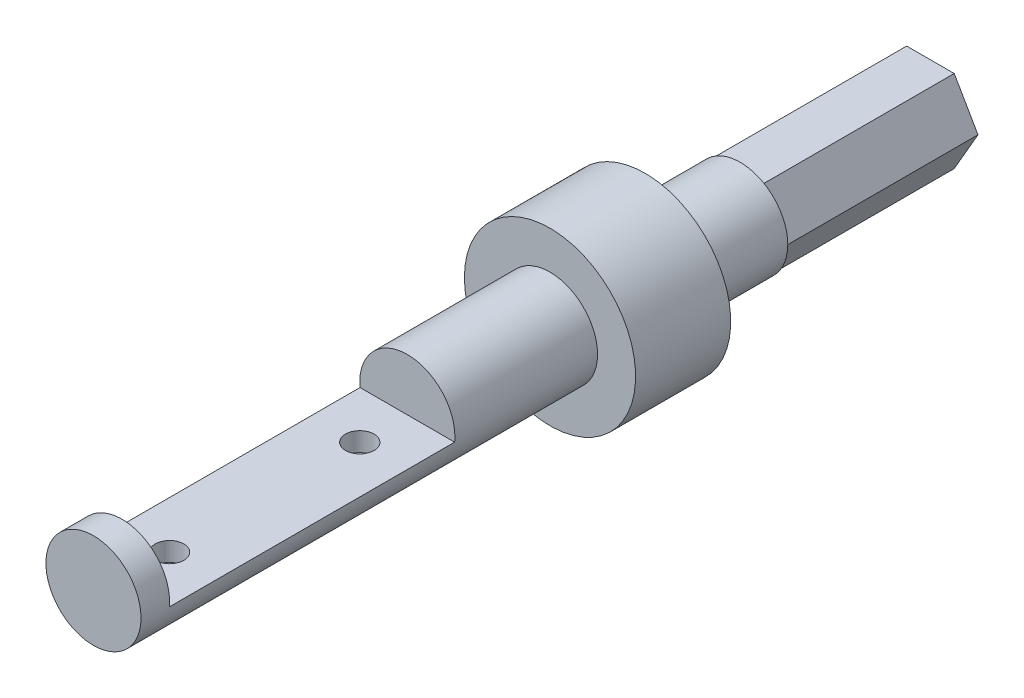
ISO-10303-21;
HEADER;
FILE_DESCRIPTION(('STEP AP214'),'2;1');
FILE_NAME('part.step','',(''),(''),'','','');
FILE_SCHEMA(('AUTOMOTIVE_DESIGN { 1 0 10303 214 1 1 1 1 }'));
ENDSEC;
DATA;
#1=APPLICATION_CONTEXT('core data for automotive mechanical design processes');
#2=APPLICATION_PROTOCOL_DEFINITION('international standard','automotive_design',2000,#1);
#3=PRODUCT_CONTEXT('',#1,'mechanical');
#4=PRODUCT('Part','Part','',(#3));
#5=PRODUCT_RELATED_PRODUCT_CATEGORY('part','',(#4));
#6=PRODUCT_DEFINITION_FORMATION('','',#4);
#7=PRODUCT_DEFINITION_CONTEXT('part definition',#1,'design');
#8=PRODUCT_DEFINITION('design','',#6,#7);
#9=PRODUCT_DEFINITION_SHAPE('','',#8);
#10=(LENGTH_UNIT() NAMED_UNIT(*) SI_UNIT(.MILLI.,.METRE.));
#11=(NAMED_UNIT(*) PLANE_ANGLE_UNIT() SI_UNIT($,.RADIAN.));
#12=(NAMED_UNIT(*) SI_UNIT($,.STERADIAN.) SOLID_ANGLE_UNIT());
#13=UNCERTAINTY_MEASURE_WITH_UNIT(LENGTH_MEASURE(1.E-05),#10,'distance_accuracy_value','');
#14=(GEOMETRIC_REPRESENTATION_CONTEXT(3) GLOBAL_UNCERTAINTY_ASSIGNED_CONTEXT((#13)) GLOBAL_UNIT_ASSIGNED_CONTEXT((#10,
#11,#12)) REPRESENTATION_CONTEXT('',''));
#15=CARTESIAN_POINT('',(0.,0.,0.));
#16=DIRECTION('',(0.,0.,1.));
#17=DIRECTION('',(1.,0.,0.));
#18=AXIS2_PLACEMENT_3D('',#15,#16,#17);
#19=CARTESIAN_POINT('',(0.,0.,-20.));
#20=DIRECTION('',(0.,0.,-1.));
#21=DIRECTION('',(-1.,0.,0.));
#22=AXIS2_PLACEMENT_3D('',#19,#20,#21);
#23=PLANE('',#22);
#24=DIRECTION('',(0.499999999999995,-0.866025403784442,0.));
#25=VECTOR('',#24,1.);
#26=CARTESIAN_POINT('',(2.50000000000005,4.33012701892217,-20.));
#27=LINE('',#26,#25);
#28=CARTESIAN_POINT('',(2.50000000000005,4.33012701892216,-20.));
#29=VERTEX_POINT('',#28);
#30=CARTESIAN_POINT('',(4.99999999999999,0.,-20.));
#31=VERTEX_POINT('',#30);
#32=EDGE_CURVE('E182',#29,#31,#27,.T.);
#33=ORIENTED_EDGE('',*,*,#32,.F.);
#34=CARTESIAN_POINT('',(0.,0.,-20.));
#35=DIRECTION('',(0.,0.,-1.));
#36=DIRECTION('',(-1.,0.,0.));
#37=AXIS2_PLACEMENT_3D('',#34,#35,#36);
#38=CIRCLE('',#37,5.);
#39=EDGE_CURVE('E291',#29,#31,#38,.T.);
#40=ORIENTED_EDGE('',*,*,#39,.T.);
#41=EDGE_LOOP('',(#33,#40));
#42=FACE_BOUND('',#41,.T.);
#43=ADVANCED_FACE('F50',(#42),#23,.T.);
#44=DIRECTION('',(1.,0.,0.));
#45=VECTOR('',#44,1.);
#46=CARTESIAN_POINT('',(-2.49999999999997,4.33012701892221,-20.));
#47=LINE('',#46,#45);
#48=CARTESIAN_POINT('',(-2.49999999999997,4.33012701892221,-20.));
#49=VERTEX_POINT('',#48);
#50=EDGE_CURVE('E168',#49,#29,#47,.T.);
#51=ORIENTED_EDGE('',*,*,#50,.F.);
#52=EDGE_CURVE('E147',#49,#29,#38,.T.);
#53=ORIENTED_EDGE('',*,*,#52,.T.);
#54=EDGE_LOOP('',(#51,#53));
#55=FACE_BOUND('',#54,.T.);
#56=ADVANCED_FACE('F238',(#55),#23,.T.);
#57=DIRECTION('',(0.500000000000007,0.866025403784435,0.));
#58=VECTOR('',#57,1.);
#59=CARTESIAN_POINT('',(-5.,0.,-20.));
#60=LINE('',#59,#58);
#61=CARTESIAN_POINT('',(-5.,0.,-20.));
#62=VERTEX_POINT('',#61);
#63=EDGE_CURVE('E172',#62,#49,#60,.T.);
#64=ORIENTED_EDGE('',*,*,#63,.F.);
#65=EDGE_CURVE('E140',#62,#49,#38,.T.);
#66=ORIENTED_EDGE('',*,*,#65,.T.);
#67=EDGE_LOOP('',(#64,#66));
#68=FACE_BOUND('',#67,.T.);
#69=ADVANCED_FACE('F245',(#68),#23,.T.);
#70=DIRECTION('',(-0.499999999999995,0.866025403784442,0.));
#71=VECTOR('',#70,1.);
#72=CARTESIAN_POINT('',(-2.50000000000002,-4.33012701892219,-20.));
#73=LINE('',#72,#71);
#74=CARTESIAN_POINT('',(-2.50000000000002,-4.33012701892219,-20.));
#75=VERTEX_POINT('',#74);
#76=EDGE_CURVE('E72',#75,#62,#73,.T.);
#77=ORIENTED_EDGE('',*,*,#76,.F.);
#78=EDGE_CURVE('E148',#75,#62,#38,.T.);
#79=ORIENTED_EDGE('',*,*,#78,.T.);
#80=EDGE_LOOP('',(#77,#79));
#81=FACE_BOUND('',#80,.T.);
#82=ADVANCED_FACE('F263',(#81),#23,.T.);
#83=DIRECTION('',(-1.,0.,0.));
#84=VECTOR('',#83,1.);
#85=CARTESIAN_POINT('',(2.49999999999998,-4.3301270189222,-20.));
#86=LINE('',#85,#84);
#87=CARTESIAN_POINT('',(2.49999999999998,-4.3301270189222,-20.));
#88=VERTEX_POINT('',#87);
#89=EDGE_CURVE('E176',#88,#75,#86,.T.);
#90=ORIENTED_EDGE('',*,*,#89,.F.);
#91=EDGE_CURVE('E273',#88,#75,#38,.T.);
#92=ORIENTED_EDGE('',*,*,#91,.T.);
#93=EDGE_LOOP('',(#90,#92));
#94=FACE_BOUND('',#93,.T.);
#95=ADVANCED_FACE('F253',(#94),#23,.T.);
#96=CARTESIAN_POINT('',(0.,0.,40.));
#97=DIRECTION('',(0.,0.,-1.));
#98=DIRECTION('',(-1.,0.,0.));
#99=AXIS2_PLACEMENT_3D('',#96,#97,#98);
#100=CYLINDRICAL_SURFACE('',#99,5.);
#101=DIRECTION('',(0.,0.,-1.));
#102=VECTOR('',#101,1.);
#103=CARTESIAN_POINT('',(-4.97493718553312,-0.5,40.));
#104=LINE('',#103,#102);
#105=CARTESIAN_POINT('',(-4.97493718553312,-0.5,45.));
#106=VERTEX_POINT('',#105);
#107=CARTESIAN_POINT('',(-4.97493718553312,-0.5,15.));
#108=VERTEX_POINT('',#107);
#109=EDGE_CURVE('E13',#106,#108,#104,.T.);
#110=ORIENTED_EDGE('',*,*,#109,.T.);
#111=CARTESIAN_POINT('',(0.,0.,15.));
#112=DIRECTION('',(0.,0.,-1.));
#113=DIRECTION('',(-1.,0.,0.));
#114=AXIS2_PLACEMENT_3D('',#111,#112,#113);
#115=CIRCLE('',#114,5.);
#116=CARTESIAN_POINT('',(4.9749371855331,-0.5,15.));
#117=VERTEX_POINT('',#116);
#118=EDGE_CURVE('E117',#108,#117,#115,.T.);
#119=ORIENTED_EDGE('',*,*,#118,.T.);
#120=DIRECTION('',(0.,0.,-1.));
#121=VECTOR('',#120,1.);
#122=CARTESIAN_POINT('',(4.9749371855331,-0.5,40.));
#123=LINE('',#122,#121);
#124=CARTESIAN_POINT('',(4.9749371855331,-0.5,45.));
#125=VERTEX_POINT('',#124);
#126=EDGE_CURVE('E123',#117,#125,#123,.F.);
#127=ORIENTED_EDGE('',*,*,#126,.T.);
#128=CARTESIAN_POINT('',(0.,0.,45.));
#129=DIRECTION('',(0.,0.,1.));
#130=DIRECTION('',(1.,0.,0.));
#131=AXIS2_PLACEMENT_3D('',#128,#129,#130);
#132=CIRCLE('',#131,5.);
#133=EDGE_CURVE('E58',#125,#106,#132,.T.);
#134=ORIENTED_EDGE('',*,*,#133,.T.);
#135=EDGE_LOOP('',(#110,#119,#127,#134));
#136=FACE_BOUND('',#135,.T.);
#137=CARTESIAN_POINT('',(0.,0.,0.));
#138=DIRECTION('',(0.,0.,1.));
#139=DIRECTION('',(1.,0.,0.));
#140=AXIS2_PLACEMENT_3D('',#137,#138,#139);
#141=CIRCLE('',#140,5.);
#142=CARTESIAN_POINT('',(5.,0.,0.));
#143=VERTEX_POINT('',#142);
#144=EDGE_CURVE('E133',#143,#143,#141,.T.);
#145=ORIENTED_EDGE('',*,*,#144,.T.);
#146=EDGE_LOOP('',(#145));
#147=FACE_BOUND('',#146,.T.);
#148=CARTESIAN_POINT('',(0.,0.,48.));
#149=DIRECTION('',(0.,0.,1.));
#150=DIRECTION('',(1.,0.,0.));
#151=AXIS2_PLACEMENT_3D('',#148,#149,#150);
#152=CIRCLE('',#151,5.);
#153=CARTESIAN_POINT('',(5.,0.,48.));
#154=VERTEX_POINT('',#153);
#155=EDGE_CURVE('E126',#154,#154,#152,.T.);
#156=ORIENTED_EDGE('',*,*,#155,.F.);
#157=EDGE_LOOP('',(#156));
#158=FACE_BOUND('',#157,.T.);
#159=ADVANCED_FACE('F52',(#136,#147,#158),#100,.T.);
#160=CARTESIAN_POINT('',(0.,0.,-10.));
#161=DIRECTION('',(0.,0.,1.));
#162=DIRECTION('',(1.,0.,0.));
#163=AXIS2_PLACEMENT_3D('',#160,#161,#162);
#164=CYLINDRICAL_SURFACE('',#163,9.);
#165=CARTESIAN_POINT('',(0.,0.,-10.));
#166=DIRECTION('',(0.,0.,-1.));
#167=DIRECTION('',(-1.,0.,0.));
#168=AXIS2_PLACEMENT_3D('',#165,#166,#167);
#169=CIRCLE('',#168,9.);
#170=CARTESIAN_POINT('',(-9.,0.,-10.));
#171=VERTEX_POINT('',#170);
#172=EDGE_CURVE('E136',#171,#171,#169,.T.);
#173=ORIENTED_EDGE('',*,*,#172,.F.);
#174=EDGE_LOOP('',(#173));
#175=FACE_BOUND('',#174,.T.);
#176=CARTESIAN_POINT('',(0.,0.,0.));
#177=DIRECTION('',(0.,0.,-1.));
#178=DIRECTION('',(-1.,0.,0.));
#179=AXIS2_PLACEMENT_3D('',#176,#177,#178);
#180=CIRCLE('',#179,9.);
#181=CARTESIAN_POINT('',(-9.,0.,0.));
#182=VERTEX_POINT('',#181);
#183=EDGE_CURVE('E137',#182,#182,#180,.T.);
#184=ORIENTED_EDGE('',*,*,#183,.T.);
#185=EDGE_LOOP('',(#184));
#186=FACE_BOUND('',#185,.T.);
#187=ADVANCED_FACE('F269',(#175,#186),#164,.T.);
#188=CARTESIAN_POINT('',(0.,0.,-10.));
#189=DIRECTION('',(0.,0.,-1.));
#190=DIRECTION('',(-1.,0.,0.));
#191=AXIS2_PLACEMENT_3D('',#188,#189,#190);
#192=PLANE('',#191);
#193=CARTESIAN_POINT('',(0.,0.,-10.));
#194=DIRECTION('',(0.,0.,-1.));
#195=DIRECTION('',(-1.,0.,0.));
#196=AXIS2_PLACEMENT_3D('',#193,#194,#195);
#197=CIRCLE('',#196,5.);
#198=CARTESIAN_POINT('',(-5.,0.,-10.));
#199=VERTEX_POINT('',#198);
#200=EDGE_CURVE('E132',#199,#199,#197,.T.);
#201=ORIENTED_EDGE('',*,*,#200,.F.);
#202=EDGE_LOOP('',(#201));
#203=FACE_BOUND('',#202,.T.);
#204=ORIENTED_EDGE('',*,*,#172,.T.);
#205=EDGE_LOOP('',(#204));
#206=FACE_BOUND('',#205,.T.);
#207=ADVANCED_FACE('F397',(#203,#206),#192,.T.);
#208=CARTESIAN_POINT('',(0.,0.,0.));
#209=DIRECTION('',(0.,0.,-1.));
#210=DIRECTION('',(-1.,0.,0.));
#211=AXIS2_PLACEMENT_3D('',#208,#209,#210);
#212=PLANE('',#211);
#213=ORIENTED_EDGE('',*,*,#144,.F.);
#214=EDGE_LOOP('',(#213));
#215=FACE_BOUND('',#214,.T.);
#216=ORIENTED_EDGE('',*,*,#183,.F.);
#217=EDGE_LOOP('',(#216));
#218=FACE_BOUND('',#217,.T.);
#219=ADVANCED_FACE('F260',(#215,#218),#212,.F.);
#220=CARTESIAN_POINT('',(0.,0.,-20.));
#221=DIRECTION('',(0.,0.,1.));
#222=DIRECTION('',(1.,0.,0.));
#223=AXIS2_PLACEMENT_3D('',#220,#221,#222);
#224=CYLINDRICAL_SURFACE('',#223,5.);
#225=ORIENTED_EDGE('',*,*,#65,.F.);
#226=ORIENTED_EDGE('',*,*,#78,.F.);
#227=ORIENTED_EDGE('',*,*,#91,.F.);
#228=EDGE_CURVE('E296',#31,#88,#38,.T.);
#229=ORIENTED_EDGE('',*,*,#228,.F.);
#230=ORIENTED_EDGE('',*,*,#39,.F.);
#231=ORIENTED_EDGE('',*,*,#52,.F.);
#232=EDGE_LOOP('',(#225,#226,#227,#229,#230,#231));
#233=FACE_BOUND('',#232,.T.);
#234=ORIENTED_EDGE('',*,*,#200,.T.);
#235=EDGE_LOOP('',(#234));
#236=FACE_BOUND('',#235,.T.);
#237=ADVANCED_FACE('F251',(#233,#236),#224,.T.);
#238=DIRECTION('',(-0.500000000000001,-0.866025403784438,0.));
#239=VECTOR('',#238,1.);
#240=CARTESIAN_POINT('',(4.99999999999999,0.,-20.));
#241=LINE('',#240,#239);
#242=EDGE_CURVE('E179',#31,#88,#241,.T.);
#243=ORIENTED_EDGE('',*,*,#242,.F.);
#244=ORIENTED_EDGE('',*,*,#228,.T.);
#245=EDGE_LOOP('',(#243,#244));
#246=FACE_BOUND('',#245,.T.);
#247=ADVANCED_FACE('F241',(#246),#23,.T.);
#248=CARTESIAN_POINT('',(2.50000000000005,4.33012701892217,-40.));
#249=DIRECTION('',(-0.866025403784442,-0.499999999999995,0.));
#250=DIRECTION('',(0.499999999999995,-0.866025403784442,0.));
#251=AXIS2_PLACEMENT_3D('',#248,#249,#250);
#252=PLANE('',#251);
#253=ORIENTED_EDGE('',*,*,#32,.T.);
#254=DIRECTION('',(0.,0.,1.));
#255=VECTOR('',#254,1.);
#256=CARTESIAN_POINT('',(4.99999999999999,0.,-40.));
#257=LINE('',#256,#255);
#258=CARTESIAN_POINT('',(4.99999999999999,0.,-40.));
#259=VERTEX_POINT('',#258);
#260=EDGE_CURVE('E149',#259,#31,#257,.T.);
#261=ORIENTED_EDGE('',*,*,#260,.F.);
#262=DIRECTION('',(0.499999999999995,-0.866025403784442,0.));
#263=VECTOR('',#262,1.);
#264=CARTESIAN_POINT('',(2.50000000000005,4.33012701892217,-40.));
#265=LINE('',#264,#263);
#266=CARTESIAN_POINT('',(2.50000000000005,4.33012701892217,-40.));
#267=VERTEX_POINT('',#266);
#268=EDGE_CURVE('E171',#267,#259,#265,.T.);
#269=ORIENTED_EDGE('',*,*,#268,.F.);
#270=DIRECTION('',(0.,0.,1.));
#271=VECTOR('',#270,1.);
#272=CARTESIAN_POINT('',(2.50000000000005,4.33012701892217,-40.));
#273=LINE('',#272,#271);
#274=EDGE_CURVE('E164',#267,#29,#273,.T.);
#275=ORIENTED_EDGE('',*,*,#274,.T.);
#276=EDGE_LOOP('',(#253,#261,#269,#275));
#277=FACE_BOUND('',#276,.T.);
#278=ADVANCED_FACE('F250',(#277),#252,.F.);
#279=CARTESIAN_POINT('',(4.99999999999999,0.,-40.));
#280=DIRECTION('',(-0.866025403784438,0.500000000000001,0.));
#281=DIRECTION('',(-0.500000000000001,-0.866025403784438,0.));
#282=AXIS2_PLACEMENT_3D('',#279,#280,#281);
#283=PLANE('',#282);
#284=ORIENTED_EDGE('',*,*,#242,.T.);
#285=DIRECTION('',(0.,0.,1.));
#286=VECTOR('',#285,1.);
#287=CARTESIAN_POINT('',(2.49999999999998,-4.3301270189222,-40.));
#288=LINE('',#287,#286);
#289=CARTESIAN_POINT('',(2.49999999999998,-4.3301270189222,-40.));
#290=VERTEX_POINT('',#289);
#291=EDGE_CURVE('E152',#290,#88,#288,.T.);
#292=ORIENTED_EDGE('',*,*,#291,.F.);
#293=DIRECTION('',(-0.500000000000001,-0.866025403784438,0.));
#294=VECTOR('',#293,1.);
#295=CARTESIAN_POINT('',(4.99999999999999,0.,-40.));
#296=LINE('',#295,#294);
#297=EDGE_CURVE('E192',#259,#290,#296,.T.);
#298=ORIENTED_EDGE('',*,*,#297,.F.);
#299=ORIENTED_EDGE('',*,*,#260,.T.);
#300=EDGE_LOOP('',(#284,#292,#298,#299));
#301=FACE_BOUND('',#300,.T.);
#302=ADVANCED_FACE('F258',(#301),#283,.F.);
#303=CARTESIAN_POINT('',(2.49999999999998,-4.3301270189222,-40.));
#304=DIRECTION('',(0.,1.,0.));
#305=DIRECTION('',(-1.,0.,0.));
#306=AXIS2_PLACEMENT_3D('',#303,#304,#305);
#307=PLANE('',#306);
#308=ORIENTED_EDGE('',*,*,#89,.T.);
#309=DIRECTION('',(0.,0.,1.));
#310=VECTOR('',#309,1.);
#311=CARTESIAN_POINT('',(-2.50000000000002,-4.33012701892219,-40.));
#312=LINE('',#311,#310);
#313=CARTESIAN_POINT('',(-2.50000000000002,-4.33012701892219,-40.));
#314=VERTEX_POINT('',#313);
#315=EDGE_CURVE('E155',#314,#75,#312,.T.);
#316=ORIENTED_EDGE('',*,*,#315,.F.);
#317=DIRECTION('',(-1.,0.,0.));
#318=VECTOR('',#317,1.);
#319=CARTESIAN_POINT('',(2.49999999999998,-4.3301270189222,-40.));
#320=LINE('',#319,#318);
#321=EDGE_CURVE('E190',#290,#314,#320,.T.);
#322=ORIENTED_EDGE('',*,*,#321,.F.);
#323=ORIENTED_EDGE('',*,*,#291,.T.);
#324=EDGE_LOOP('',(#308,#316,#322,#323));
#325=FACE_BOUND('',#324,.T.);
#326=ADVANCED_FACE('F281',(#325),#307,.F.);
#327=CARTESIAN_POINT('',(-2.50000000000002,-4.33012701892219,-40.));
#328=DIRECTION('',(0.866025403784442,0.499999999999995,0.));
#329=DIRECTION('',(-0.499999999999995,0.866025403784442,0.));
#330=AXIS2_PLACEMENT_3D('',#327,#328,#329);
#331=PLANE('',#330);
#332=ORIENTED_EDGE('',*,*,#76,.T.);
#333=DIRECTION('',(0.,0.,1.));
#334=VECTOR('',#333,1.);
#335=CARTESIAN_POINT('',(-5.,0.,-40.));
#336=LINE('',#335,#334);
#337=CARTESIAN_POINT('',(-5.,0.,-40.));
#338=VERTEX_POINT('',#337);
#339=EDGE_CURVE('E158',#338,#62,#336,.T.);
#340=ORIENTED_EDGE('',*,*,#339,.F.);
#341=DIRECTION('',(-0.499999999999995,0.866025403784442,0.));
#342=VECTOR('',#341,1.);
#343=CARTESIAN_POINT('',(-2.50000000000002,-4.33012701892219,-40.));
#344=LINE('',#343,#342);
#345=EDGE_CURVE('E188',#314,#338,#344,.T.);
#346=ORIENTED_EDGE('',*,*,#345,.F.);
#347=ORIENTED_EDGE('',*,*,#315,.T.);
#348=EDGE_LOOP('',(#332,#340,#346,#347));
#349=FACE_BOUND('',#348,.T.);
#350=ADVANCED_FACE('F305',(#349),#331,.F.);
#351=CARTESIAN_POINT('',(-5.,0.,-40.));
#352=DIRECTION('',(0.866025403784435,-0.500000000000007,0.));
#353=DIRECTION('',(0.500000000000007,0.866025403784435,0.));
#354=AXIS2_PLACEMENT_3D('',#351,#352,#353);
#355=PLANE('',#354);
#356=ORIENTED_EDGE('',*,*,#63,.T.);
#357=DIRECTION('',(0.,0.,1.));
#358=VECTOR('',#357,1.);
#359=CARTESIAN_POINT('',(-2.49999999999997,4.33012701892221,-40.));
#360=LINE('',#359,#358);
#361=CARTESIAN_POINT('',(-2.49999999999997,4.33012701892221,-40.));
#362=VERTEX_POINT('',#361);
#363=EDGE_CURVE('E161',#362,#49,#360,.T.);
#364=ORIENTED_EDGE('',*,*,#363,.F.);
#365=DIRECTION('',(0.500000000000007,0.866025403784435,0.));
#366=VECTOR('',#365,1.);
#367=CARTESIAN_POINT('',(-5.,0.,-40.));
#368=LINE('',#367,#366);
#369=EDGE_CURVE('E186',#338,#362,#368,.T.);
#370=ORIENTED_EDGE('',*,*,#369,.F.);
#371=ORIENTED_EDGE('',*,*,#339,.T.);
#372=EDGE_LOOP('',(#356,#364,#370,#371));
#373=FACE_BOUND('',#372,.T.);
#374=ADVANCED_FACE('F302',(#373),#355,.F.);
#375=CARTESIAN_POINT('',(-2.49999999999997,4.33012701892221,-40.));
#376=DIRECTION('',(0.,-1.,0.));
#377=DIRECTION('',(1.,0.,0.));
#378=AXIS2_PLACEMENT_3D('',#375,#376,#377);
#379=PLANE('',#378);
#380=ORIENTED_EDGE('',*,*,#50,.T.);
#381=ORIENTED_EDGE('',*,*,#274,.F.);
#382=DIRECTION('',(1.,0.,0.));
#383=VECTOR('',#382,1.);
#384=CARTESIAN_POINT('',(-2.49999999999997,4.33012701892221,-40.));
#385=LINE('',#384,#383);
#386=EDGE_CURVE('E167',#362,#267,#385,.T.);
#387=ORIENTED_EDGE('',*,*,#386,.F.);
#388=ORIENTED_EDGE('',*,*,#363,.T.);
#389=EDGE_LOOP('',(#380,#381,#387,#388));
#390=FACE_BOUND('',#389,.T.);
#391=ADVANCED_FACE('F298',(#390),#379,.F.);
#392=CARTESIAN_POINT('',(0.,0.,-40.));
#393=DIRECTION('',(0.,0.,-1.));
#394=DIRECTION('',(-1.,0.,0.));
#395=AXIS2_PLACEMENT_3D('',#392,#393,#394);
#396=PLANE('',#395);
#397=ORIENTED_EDGE('',*,*,#268,.T.);
#398=ORIENTED_EDGE('',*,*,#297,.T.);
#399=ORIENTED_EDGE('',*,*,#321,.T.);
#400=ORIENTED_EDGE('',*,*,#345,.T.);
#401=ORIENTED_EDGE('',*,*,#369,.T.);
#402=ORIENTED_EDGE('',*,*,#386,.T.);
#403=EDGE_LOOP('',(#397,#398,#399,#400,#401,#402));
#404=FACE_BOUND('',#403,.T.);
#405=ADVANCED_FACE('F284',(#404),#396,.T.);
#406=CARTESIAN_POINT('',(0.,0.,48.));
#407=DIRECTION('',(0.,0.,1.));
#408=DIRECTION('',(1.,0.,0.));
#409=AXIS2_PLACEMENT_3D('',#406,#407,#408);
#410=PLANE('',#409);
#411=ORIENTED_EDGE('',*,*,#155,.T.);
#412=EDGE_LOOP('',(#411));
#413=FACE_BOUND('',#412,.T.);
#414=ADVANCED_FACE('F343',(#413),#410,.T.);
#415=CARTESIAN_POINT('',(-9.,5.,45.));
#416=DIRECTION('',(0.,0.,1.));
#417=DIRECTION('',(1.,0.,0.));
#418=AXIS2_PLACEMENT_3D('',#415,#416,#417);
#419=PLANE('',#418);
#420=ORIENTED_EDGE('',*,*,#133,.F.);
#421=DIRECTION('',(1.,0.,0.));
#422=VECTOR('',#421,1.);
#423=CARTESIAN_POINT('',(-9.,-0.5,45.));
#424=LINE('',#423,#422);
#425=EDGE_CURVE('E65',#106,#125,#424,.T.);
#426=ORIENTED_EDGE('',*,*,#425,.F.);
#427=EDGE_LOOP('',(#420,#426));
#428=FACE_BOUND('',#427,.T.);
#429=ADVANCED_FACE('F359',(#428),#419,.F.);
#430=CARTESIAN_POINT('',(-9.,5.,15.));
#431=DIRECTION('',(0.,0.,-1.));
#432=DIRECTION('',(-1.,0.,0.));
#433=AXIS2_PLACEMENT_3D('',#430,#431,#432);
#434=PLANE('',#433);
#435=ORIENTED_EDGE('',*,*,#118,.F.);
#436=DIRECTION('',(1.,0.,0.));
#437=VECTOR('',#436,1.);
#438=CARTESIAN_POINT('',(-9.,-0.5,15.));
#439=LINE('',#438,#437);
#440=EDGE_CURVE('E120',#108,#117,#439,.T.);
#441=ORIENTED_EDGE('',*,*,#440,.T.);
#442=EDGE_LOOP('',(#435,#441));
#443=FACE_BOUND('',#442,.T.);
#444=ADVANCED_FACE('F119',(#443),#434,.F.);
#445=CARTESIAN_POINT('',(-9.,-0.5,45.));
#446=DIRECTION('',(0.,-1.,0.));
#447=DIRECTION('',(0.,0.,-1.));
#448=AXIS2_PLACEMENT_3D('',#445,#446,#447);
#449=PLANE('',#448);
#450=CARTESIAN_POINT('',(0.,-0.499999999999997,40.));
#451=DIRECTION('',(0.,1.,0.));
#452=DIRECTION('',(0.,0.,1.));
#453=AXIS2_PLACEMENT_3D('',#450,#451,#452);
#454=CIRCLE('',#453,1.5);
#455=CARTESIAN_POINT('',(0.,-0.499999999999997,41.5));
#456=VERTEX_POINT('',#455);
#457=EDGE_CURVE('E206',#456,#456,#454,.T.);
#458=ORIENTED_EDGE('',*,*,#457,.F.);
#459=EDGE_LOOP('',(#458));
#460=FACE_BOUND('',#459,.T.);
#461=CARTESIAN_POINT('',(0.,-0.499999999999997,20.));
#462=DIRECTION('',(0.,1.,0.));
#463=DIRECTION('',(0.,0.,-1.));
#464=AXIS2_PLACEMENT_3D('',#461,#462,#463);
#465=CIRCLE('',#464,1.5);
#466=CARTESIAN_POINT('',(0.,-0.499999999999997,18.5));
#467=VERTEX_POINT('',#466);
#468=EDGE_CURVE('E200',#467,#467,#465,.T.);
#469=ORIENTED_EDGE('',*,*,#468,.F.);
#470=EDGE_LOOP('',(#469));
#471=FACE_BOUND('',#470,.T.);
#472=ORIENTED_EDGE('',*,*,#425,.T.);
#473=ORIENTED_EDGE('',*,*,#126,.F.);
#474=ORIENTED_EDGE('',*,*,#440,.F.);
#475=ORIENTED_EDGE('',*,*,#109,.F.);
#476=EDGE_LOOP('',(#472,#473,#474,#475));
#477=FACE_BOUND('',#476,.T.);
#478=ADVANCED_FACE('F125',(#460,#471,#477),#449,.F.);
#479=CARTESIAN_POINT('',(0.,-2.5,20.));
#480=DIRECTION('',(0.,1.,0.));
#481=DIRECTION('',(0.,0.,1.));
#482=AXIS2_PLACEMENT_3D('',#479,#480,#481);
#483=CYLINDRICAL_SURFACE('',#482,1.5);
#484=CARTESIAN_POINT('',(0.,-2.5,20.));
#485=DIRECTION('',(0.,1.,0.));
#486=DIRECTION('',(0.,0.,-1.));
#487=AXIS2_PLACEMENT_3D('',#484,#485,#486);
#488=CIRCLE('',#487,1.5);
#489=CARTESIAN_POINT('',(0.,-2.5,18.5));
#490=VERTEX_POINT('',#489);
#491=EDGE_CURVE('E203',#490,#490,#488,.T.);
#492=ORIENTED_EDGE('',*,*,#491,.F.);
#493=EDGE_LOOP('',(#492));
#494=FACE_BOUND('',#493,.T.);
#495=ORIENTED_EDGE('',*,*,#468,.T.);
#496=EDGE_LOOP('',(#495));
#497=FACE_BOUND('',#496,.T.);
#498=ADVANCED_FACE('F223',(#494,#497),#483,.F.);
#499=CARTESIAN_POINT('',(0.,-2.5,20.));
#500=DIRECTION('',(0.,-1.,0.));
#501=DIRECTION('',(0.,0.,-1.));
#502=AXIS2_PLACEMENT_3D('',#499,#500,#501);
#503=PLANE('',#502);
#504=ORIENTED_EDGE('',*,*,#491,.T.);
#505=EDGE_LOOP('',(#504));
#506=FACE_BOUND('',#505,.T.);
#507=ADVANCED_FACE('F217',(#506),#503,.F.);
#508=CARTESIAN_POINT('',(0.,-2.5,40.));
#509=DIRECTION('',(0.,1.,0.));
#510=DIRECTION('',(0.,0.,1.));
#511=AXIS2_PLACEMENT_3D('',#508,#509,#510);
#512=CYLINDRICAL_SURFACE('',#511,1.5);
#513=CARTESIAN_POINT('',(0.,-2.5,40.));
#514=DIRECTION('',(0.,1.,0.));
#515=DIRECTION('',(0.,0.,1.));
#516=AXIS2_PLACEMENT_3D('',#513,#514,#515);
#517=CIRCLE('',#516,1.5);
#518=CARTESIAN_POINT('',(0.,-2.5,41.5));
#519=VERTEX_POINT('',#518);
#520=EDGE_CURVE('E198',#519,#519,#517,.T.);
#521=ORIENTED_EDGE('',*,*,#520,.F.);
#522=EDGE_LOOP('',(#521));
#523=FACE_BOUND('',#522,.T.);
#524=ORIENTED_EDGE('',*,*,#457,.T.);
#525=EDGE_LOOP('',(#524));
#526=FACE_BOUND('',#525,.T.);
#527=ADVANCED_FACE('F214',(#523,#526),#512,.F.);
#528=CARTESIAN_POINT('',(0.,-2.5,40.));
#529=DIRECTION('',(0.,1.,0.));
#530=DIRECTION('',(0.,0.,1.));
#531=AXIS2_PLACEMENT_3D('',#528,#529,#530);
#532=PLANE('',#531);
#533=ORIENTED_EDGE('',*,*,#520,.T.);
#534=EDGE_LOOP('',(#533));
#535=FACE_BOUND('',#534,.T.);
#536=ADVANCED_FACE('F212',(#535),#532,.T.);
#537=CLOSED_SHELL('',(#43,#56,#69,#82,#95,#159,#187,#207,#219,#237,#247,#278,#302,#326,#350,
#374,#391,#405,#414,#429,#444,#478,#498,#507,#527,#536));
#538=MANIFOLD_SOLID_BREP('B2',#537);
#539=ADVANCED_BREP_SHAPE_REPRESENTATION('',(#18,#538),#14);
#540=SHAPE_DEFINITION_REPRESENTATION(#9,#539);
ENDSEC;
END-ISO-10303-21;
